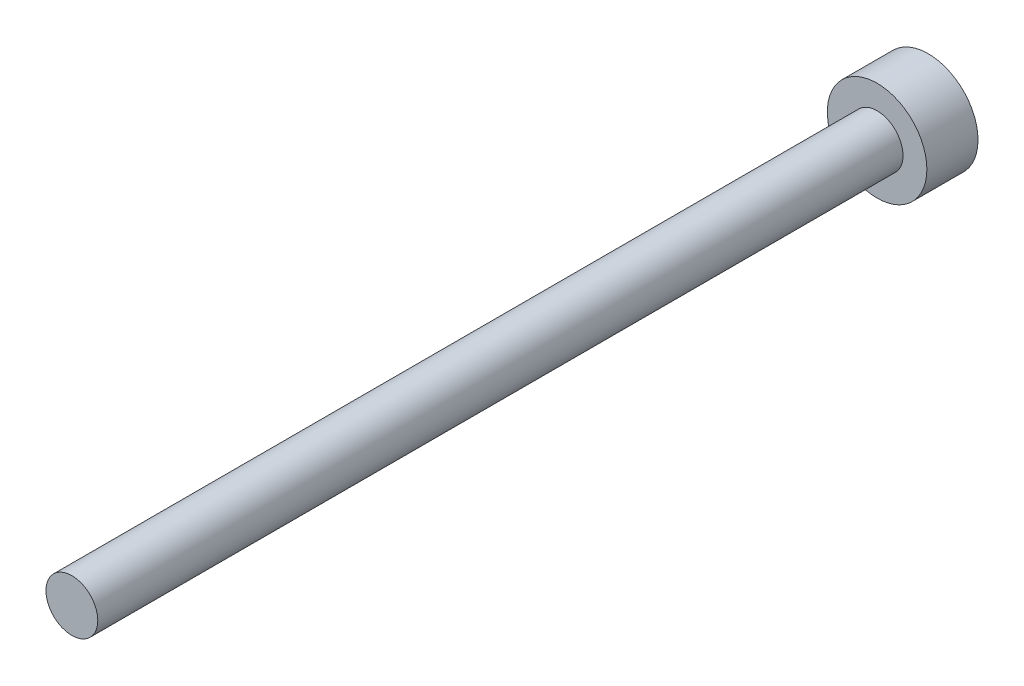
ISO-10303-21;
HEADER;
FILE_DESCRIPTION(('STEP AP214'),'2;1');
FILE_NAME('part.step','',(''),(''),'','','');
FILE_SCHEMA(('AUTOMOTIVE_DESIGN { 1 0 10303 214 1 1 1 1 }'));
ENDSEC;
DATA;
#1=APPLICATION_CONTEXT('core data for automotive mechanical design processes');
#2=APPLICATION_PROTOCOL_DEFINITION('international standard','automotive_design',2000,#1);
#3=PRODUCT_CONTEXT('',#1,'mechanical');
#4=PRODUCT('Part','Part','',(#3));
#5=PRODUCT_RELATED_PRODUCT_CATEGORY('part','',(#4));
#6=PRODUCT_DEFINITION_FORMATION('','',#4);
#7=PRODUCT_DEFINITION_CONTEXT('part definition',#1,'design');
#8=PRODUCT_DEFINITION('design','',#6,#7);
#9=PRODUCT_DEFINITION_SHAPE('','',#8);
#10=(LENGTH_UNIT() NAMED_UNIT(*) SI_UNIT(.MILLI.,.METRE.));
#11=(NAMED_UNIT(*) PLANE_ANGLE_UNIT() SI_UNIT($,.RADIAN.));
#12=(NAMED_UNIT(*) SI_UNIT($,.STERADIAN.) SOLID_ANGLE_UNIT());
#13=UNCERTAINTY_MEASURE_WITH_UNIT(LENGTH_MEASURE(1.E-05),#10,'distance_accuracy_value','');
#14=(GEOMETRIC_REPRESENTATION_CONTEXT(3) GLOBAL_UNCERTAINTY_ASSIGNED_CONTEXT((#13)) GLOBAL_UNIT_ASSIGNED_CONTEXT((#10,
#11,#12)) REPRESENTATION_CONTEXT('',''));
#15=CARTESIAN_POINT('',(0.,0.,0.));
#16=DIRECTION('',(0.,0.,1.));
#17=DIRECTION('',(1.,0.,0.));
#18=AXIS2_PLACEMENT_3D('',#15,#16,#17);
#19=CARTESIAN_POINT('',(0.,0.,30.));
#20=DIRECTION('',(0.,0.,-1.));
#21=DIRECTION('',(-1.,0.,0.));
#22=AXIS2_PLACEMENT_3D('',#19,#20,#21);
#23=CYLINDRICAL_SURFACE('',#22,0.9652);
#24=CARTESIAN_POINT('',(0.,0.,30.));
#25=DIRECTION('',(0.,0.,1.));
#26=DIRECTION('',(1.,0.,0.));
#27=AXIS2_PLACEMENT_3D('',#24,#25,#26);
#28=CIRCLE('',#27,0.9652);
#29=CARTESIAN_POINT('',(0.9652,0.,30.));
#30=VERTEX_POINT('',#29);
#31=EDGE_CURVE('E11',#30,#30,#28,.T.);
#32=ORIENTED_EDGE('',*,*,#31,.F.);
#33=EDGE_LOOP('',(#32));
#34=FACE_BOUND('',#33,.T.);
#35=CARTESIAN_POINT('',(0.,0.,0.));
#36=DIRECTION('',(0.,0.,1.));
#37=DIRECTION('',(1.,0.,0.));
#38=AXIS2_PLACEMENT_3D('',#35,#36,#37);
#39=CIRCLE('',#38,0.9652);
#40=CARTESIAN_POINT('',(0.9652,0.,0.));
#41=VERTEX_POINT('',#40);
#42=EDGE_CURVE('E48',#41,#41,#39,.T.);
#43=ORIENTED_EDGE('',*,*,#42,.T.);
#44=EDGE_LOOP('',(#43));
#45=FACE_BOUND('',#44,.T.);
#46=ADVANCED_FACE('F45',(#34,#45),#23,.T.);
#47=CARTESIAN_POINT('',(0.,0.,30.));
#48=DIRECTION('',(0.,0.,1.));
#49=DIRECTION('',(1.,0.,0.));
#50=AXIS2_PLACEMENT_3D('',#47,#48,#49);
#51=PLANE('',#50);
#52=ORIENTED_EDGE('',*,*,#31,.T.);
#53=EDGE_LOOP('',(#52));
#54=FACE_BOUND('',#53,.T.);
#55=ADVANCED_FACE('F182',(#54),#51,.T.);
#56=CARTESIAN_POINT('',(0.,0.,-1.905));
#57=DIRECTION('',(0.,0.,1.));
#58=DIRECTION('',(1.,0.,0.));
#59=AXIS2_PLACEMENT_3D('',#56,#57,#58);
#60=CYLINDRICAL_SURFACE('',#59,1.8542);
#61=CARTESIAN_POINT('',(0.,0.,-1.905));
#62=DIRECTION('',(0.,0.,1.));
#63=DIRECTION('',(1.,0.,0.));
#64=AXIS2_PLACEMENT_3D('',#61,#62,#63);
#65=CIRCLE('',#64,1.8542);
#66=CARTESIAN_POINT('',(1.8542,0.,-1.905));
#67=VERTEX_POINT('',#66);
#68=EDGE_CURVE('E169',#67,#67,#65,.T.);
#69=ORIENTED_EDGE('',*,*,#68,.T.);
#70=EDGE_LOOP('',(#69));
#71=FACE_BOUND('',#70,.T.);
#72=CARTESIAN_POINT('',(0.,0.,0.));
#73=DIRECTION('',(0.,0.,1.));
#74=DIRECTION('',(1.,0.,0.));
#75=AXIS2_PLACEMENT_3D('',#72,#73,#74);
#76=CIRCLE('',#75,1.8542);
#77=CARTESIAN_POINT('',(1.8542,0.,0.));
#78=VERTEX_POINT('',#77);
#79=EDGE_CURVE('E159',#78,#78,#76,.T.);
#80=ORIENTED_EDGE('',*,*,#79,.F.);
#81=EDGE_LOOP('',(#80));
#82=FACE_BOUND('',#81,.T.);
#83=ADVANCED_FACE('F179',(#71,#82),#60,.T.);
#84=CARTESIAN_POINT('',(0.,0.,-1.905));
#85=DIRECTION('',(0.,0.,1.));
#86=DIRECTION('',(1.,0.,0.));
#87=AXIS2_PLACEMENT_3D('',#84,#85,#86);
#88=PLANE('',#87);
#89=DIRECTION('',(0.5,0.866025403784439,0.));
#90=VECTOR('',#89,1.);
#91=CARTESIAN_POINT('',(-0.850552416570157,0.,-1.905));
#92=LINE('',#91,#90);
#93=CARTESIAN_POINT('',(-0.850552416570157,0.,-1.905));
#94=VERTEX_POINT('',#93);
#95=CARTESIAN_POINT('',(-0.425276208285078,0.7366,-1.905));
#96=VERTEX_POINT('',#95);
#97=EDGE_CURVE('E140',#94,#96,#92,.T.);
#98=ORIENTED_EDGE('',*,*,#97,.F.);
#99=DIRECTION('',(-0.5,0.866025403784439,0.));
#100=VECTOR('',#99,1.);
#101=CARTESIAN_POINT('',(-0.425276208285078,-0.7366,-1.905));
#102=LINE('',#101,#100);
#103=CARTESIAN_POINT('',(-0.425276208285078,-0.7366,-1.905));
#104=VERTEX_POINT('',#103);
#105=EDGE_CURVE('E60',#104,#94,#102,.T.);
#106=ORIENTED_EDGE('',*,*,#105,.F.);
#107=DIRECTION('',(-1.,0.,0.));
#108=VECTOR('',#107,1.);
#109=CARTESIAN_POINT('',(0.425276208285078,-0.7366,-1.905));
#110=LINE('',#109,#108);
#111=CARTESIAN_POINT('',(0.425276208285078,-0.7366,-1.905));
#112=VERTEX_POINT('',#111);
#113=EDGE_CURVE('E153',#112,#104,#110,.T.);
#114=ORIENTED_EDGE('',*,*,#113,.F.);
#115=DIRECTION('',(-0.5,-0.866025403784438,0.));
#116=VECTOR('',#115,1.);
#117=CARTESIAN_POINT('',(0.850552416570157,0.,-1.905));
#118=LINE('',#117,#116);
#119=CARTESIAN_POINT('',(0.850552416570157,0.,-1.905));
#120=VERTEX_POINT('',#119);
#121=EDGE_CURVE('E150',#120,#112,#118,.T.);
#122=ORIENTED_EDGE('',*,*,#121,.F.);
#123=DIRECTION('',(0.5,-0.866025403784439,0.));
#124=VECTOR('',#123,1.);
#125=CARTESIAN_POINT('',(0.425276208285078,0.7366,-1.905));
#126=LINE('',#125,#124);
#127=CARTESIAN_POINT('',(0.425276208285078,0.7366,-1.905));
#128=VERTEX_POINT('',#127);
#129=EDGE_CURVE('E108',#128,#120,#126,.T.);
#130=ORIENTED_EDGE('',*,*,#129,.F.);
#131=DIRECTION('',(1.,0.,0.));
#132=VECTOR('',#131,1.);
#133=CARTESIAN_POINT('',(-0.425276208285078,0.7366,-1.905));
#134=LINE('',#133,#132);
#135=EDGE_CURVE('E144',#96,#128,#134,.T.);
#136=ORIENTED_EDGE('',*,*,#135,.F.);
#137=EDGE_LOOP('',(#98,#106,#114,#122,#130,#136));
#138=FACE_BOUND('',#137,.T.);
#139=ORIENTED_EDGE('',*,*,#68,.F.);
#140=EDGE_LOOP('',(#139));
#141=FACE_BOUND('',#140,.T.);
#142=ADVANCED_FACE('F181',(#138,#141),#88,.F.);
#143=CARTESIAN_POINT('',(0.,0.,0.));
#144=DIRECTION('',(0.,0.,1.));
#145=DIRECTION('',(1.,0.,0.));
#146=AXIS2_PLACEMENT_3D('',#143,#144,#145);
#147=PLANE('',#146);
#148=ORIENTED_EDGE('',*,*,#42,.F.);
#149=EDGE_LOOP('',(#148));
#150=FACE_BOUND('',#149,.T.);
#151=ORIENTED_EDGE('',*,*,#79,.T.);
#152=EDGE_LOOP('',(#151));
#153=FACE_BOUND('',#152,.T.);
#154=ADVANCED_FACE('F177',(#150,#153),#147,.T.);
#155=CARTESIAN_POINT('',(-0.425276208285078,-0.7366,-0.381));
#156=DIRECTION('',(-0.866025403784439,-0.5,0.));
#157=DIRECTION('',(0.5,-0.866025403784439,0.));
#158=AXIS2_PLACEMENT_3D('',#155,#156,#157);
#159=PLANE('',#158);
#160=ORIENTED_EDGE('',*,*,#105,.T.);
#161=DIRECTION('',(0.,0.,-1.));
#162=VECTOR('',#161,1.);
#163=CARTESIAN_POINT('',(-0.850552416570157,0.,-0.381));
#164=LINE('',#163,#162);
#165=CARTESIAN_POINT('',(-0.850552416570157,0.,-0.381));
#166=VERTEX_POINT('',#165);
#167=EDGE_CURVE('E90',#166,#94,#164,.T.);
#168=ORIENTED_EDGE('',*,*,#167,.F.);
#169=DIRECTION('',(-0.5,0.866025403784439,0.));
#170=VECTOR('',#169,1.);
#171=CARTESIAN_POINT('',(-0.425276208285078,-0.7366,-0.381));
#172=LINE('',#171,#170);
#173=CARTESIAN_POINT('',(-0.425276208285078,-0.7366,-0.381));
#174=VERTEX_POINT('',#173);
#175=EDGE_CURVE('E156',#174,#166,#172,.T.);
#176=ORIENTED_EDGE('',*,*,#175,.F.);
#177=DIRECTION('',(0.,0.,-1.));
#178=VECTOR('',#177,1.);
#179=CARTESIAN_POINT('',(-0.425276208285078,-0.7366,-0.381));
#180=LINE('',#179,#178);
#181=EDGE_CURVE('E68',#174,#104,#180,.T.);
#182=ORIENTED_EDGE('',*,*,#181,.T.);
#183=EDGE_LOOP('',(#160,#168,#176,#182));
#184=FACE_BOUND('',#183,.T.);
#185=ADVANCED_FACE('F204',(#184),#159,.F.);
#186=CARTESIAN_POINT('',(0.425276208285078,-0.7366,-0.381));
#187=DIRECTION('',(0.,-1.,0.));
#188=DIRECTION('',(0.,0.,-1.));
#189=AXIS2_PLACEMENT_3D('',#186,#187,#188);
#190=PLANE('',#189);
#191=ORIENTED_EDGE('',*,*,#113,.T.);
#192=ORIENTED_EDGE('',*,*,#181,.F.);
#193=DIRECTION('',(-1.,0.,0.));
#194=VECTOR('',#193,1.);
#195=CARTESIAN_POINT('',(0.425276208285078,-0.7366,-0.381));
#196=LINE('',#195,#194);
#197=CARTESIAN_POINT('',(0.425276208285078,-0.7366,-0.381));
#198=VERTEX_POINT('',#197);
#199=EDGE_CURVE('E122',#198,#174,#196,.T.);
#200=ORIENTED_EDGE('',*,*,#199,.F.);
#201=DIRECTION('',(0.,0.,-1.));
#202=VECTOR('',#201,1.);
#203=CARTESIAN_POINT('',(0.425276208285078,-0.7366,-0.381));
#204=LINE('',#203,#202);
#205=EDGE_CURVE('E113',#198,#112,#204,.T.);
#206=ORIENTED_EDGE('',*,*,#205,.T.);
#207=EDGE_LOOP('',(#191,#192,#200,#206));
#208=FACE_BOUND('',#207,.T.);
#209=ADVANCED_FACE('F208',(#208),#190,.F.);
#210=CARTESIAN_POINT('',(0.850552416570157,0.,-0.381));
#211=DIRECTION('',(0.866025403784438,-0.5,0.));
#212=DIRECTION('',(0.5,0.866025403784439,0.));
#213=AXIS2_PLACEMENT_3D('',#210,#211,#212);
#214=PLANE('',#213);
#215=ORIENTED_EDGE('',*,*,#121,.T.);
#216=ORIENTED_EDGE('',*,*,#205,.F.);
#217=DIRECTION('',(-0.5,-0.866025403784438,0.));
#218=VECTOR('',#217,1.);
#219=CARTESIAN_POINT('',(0.850552416570157,0.,-0.381));
#220=LINE('',#219,#218);
#221=CARTESIAN_POINT('',(0.850552416570157,0.,-0.381));
#222=VERTEX_POINT('',#221);
#223=EDGE_CURVE('E117',#222,#198,#220,.T.);
#224=ORIENTED_EDGE('',*,*,#223,.F.);
#225=DIRECTION('',(0.,0.,-1.));
#226=VECTOR('',#225,1.);
#227=CARTESIAN_POINT('',(0.850552416570157,0.,-0.381));
#228=LINE('',#227,#226);
#229=EDGE_CURVE('E101',#222,#120,#228,.T.);
#230=ORIENTED_EDGE('',*,*,#229,.T.);
#231=EDGE_LOOP('',(#215,#216,#224,#230));
#232=FACE_BOUND('',#231,.T.);
#233=ADVANCED_FACE('F118',(#232),#214,.F.);
#234=CARTESIAN_POINT('',(0.425276208285078,0.7366,-0.381));
#235=DIRECTION('',(0.866025403784439,0.5,0.));
#236=DIRECTION('',(-0.5,0.866025403784439,0.));
#237=AXIS2_PLACEMENT_3D('',#234,#235,#236);
#238=PLANE('',#237);
#239=ORIENTED_EDGE('',*,*,#129,.T.);
#240=ORIENTED_EDGE('',*,*,#229,.F.);
#241=DIRECTION('',(0.5,-0.866025403784439,0.));
#242=VECTOR('',#241,1.);
#243=CARTESIAN_POINT('',(0.425276208285078,0.7366,-0.381));
#244=LINE('',#243,#242);
#245=CARTESIAN_POINT('',(0.425276208285078,0.7366,-0.381));
#246=VERTEX_POINT('',#245);
#247=EDGE_CURVE('E105',#246,#222,#244,.T.);
#248=ORIENTED_EDGE('',*,*,#247,.F.);
#249=DIRECTION('',(0.,0.,-1.));
#250=VECTOR('',#249,1.);
#251=CARTESIAN_POINT('',(0.425276208285078,0.7366,-0.381));
#252=LINE('',#251,#250);
#253=EDGE_CURVE('E114',#246,#128,#252,.T.);
#254=ORIENTED_EDGE('',*,*,#253,.T.);
#255=EDGE_LOOP('',(#239,#240,#248,#254));
#256=FACE_BOUND('',#255,.T.);
#257=ADVANCED_FACE('F103',(#256),#238,.F.);
#258=CARTESIAN_POINT('',(-0.425276208285078,0.7366,-0.381));
#259=DIRECTION('',(0.,1.,0.));
#260=DIRECTION('',(0.,0.,1.));
#261=AXIS2_PLACEMENT_3D('',#258,#259,#260);
#262=PLANE('',#261);
#263=ORIENTED_EDGE('',*,*,#135,.T.);
#264=ORIENTED_EDGE('',*,*,#253,.F.);
#265=DIRECTION('',(1.,0.,0.));
#266=VECTOR('',#265,1.);
#267=CARTESIAN_POINT('',(-0.425276208285078,0.7366,-0.381));
#268=LINE('',#267,#266);
#269=CARTESIAN_POINT('',(-0.425276208285078,0.7366,-0.381));
#270=VERTEX_POINT('',#269);
#271=EDGE_CURVE('E128',#270,#246,#268,.T.);
#272=ORIENTED_EDGE('',*,*,#271,.F.);
#273=DIRECTION('',(0.,0.,-1.));
#274=VECTOR('',#273,1.);
#275=CARTESIAN_POINT('',(-0.425276208285078,0.7366,-0.381));
#276=LINE('',#275,#274);
#277=EDGE_CURVE('E164',#270,#96,#276,.T.);
#278=ORIENTED_EDGE('',*,*,#277,.T.);
#279=EDGE_LOOP('',(#263,#264,#272,#278));
#280=FACE_BOUND('',#279,.T.);
#281=ADVANCED_FACE('F214',(#280),#262,.F.);
#282=CARTESIAN_POINT('',(-0.850552416570157,0.,-0.381));
#283=DIRECTION('',(-0.866025403784439,0.5,0.));
#284=DIRECTION('',(-0.5,-0.866025403784439,0.));
#285=AXIS2_PLACEMENT_3D('',#282,#283,#284);
#286=PLANE('',#285);
#287=ORIENTED_EDGE('',*,*,#97,.T.);
#288=ORIENTED_EDGE('',*,*,#277,.F.);
#289=DIRECTION('',(0.5,0.866025403784439,0.));
#290=VECTOR('',#289,1.);
#291=CARTESIAN_POINT('',(-0.850552416570157,0.,-0.381));
#292=LINE('',#291,#290);
#293=EDGE_CURVE('E132',#166,#270,#292,.T.);
#294=ORIENTED_EDGE('',*,*,#293,.F.);
#295=ORIENTED_EDGE('',*,*,#167,.T.);
#296=EDGE_LOOP('',(#287,#288,#294,#295));
#297=FACE_BOUND('',#296,.T.);
#298=ADVANCED_FACE('F211',(#297),#286,.F.);
#299=CARTESIAN_POINT('',(0.,0.,-0.381));
#300=DIRECTION('',(0.,0.,-1.));
#301=DIRECTION('',(-1.,0.,0.));
#302=AXIS2_PLACEMENT_3D('',#299,#300,#301);
#303=PLANE('',#302);
#304=ORIENTED_EDGE('',*,*,#175,.T.);
#305=ORIENTED_EDGE('',*,*,#293,.T.);
#306=ORIENTED_EDGE('',*,*,#271,.T.);
#307=ORIENTED_EDGE('',*,*,#247,.T.);
#308=ORIENTED_EDGE('',*,*,#223,.T.);
#309=ORIENTED_EDGE('',*,*,#199,.T.);
#310=EDGE_LOOP('',(#304,#305,#306,#307,#308,#309));
#311=FACE_BOUND('',#310,.T.);
#312=ADVANCED_FACE('F125',(#311),#303,.T.);
#313=CLOSED_SHELL('',(#46,#55,#83,#142,#154,#185,#209,#233,#257,#281,#298,#312));
#314=MANIFOLD_SOLID_BREP('B2',#313);
#315=ADVANCED_BREP_SHAPE_REPRESENTATION('',(#18,#314),#14);
#316=SHAPE_DEFINITION_REPRESENTATION(#9,#315);
ENDSEC;
END-ISO-10303-21;
